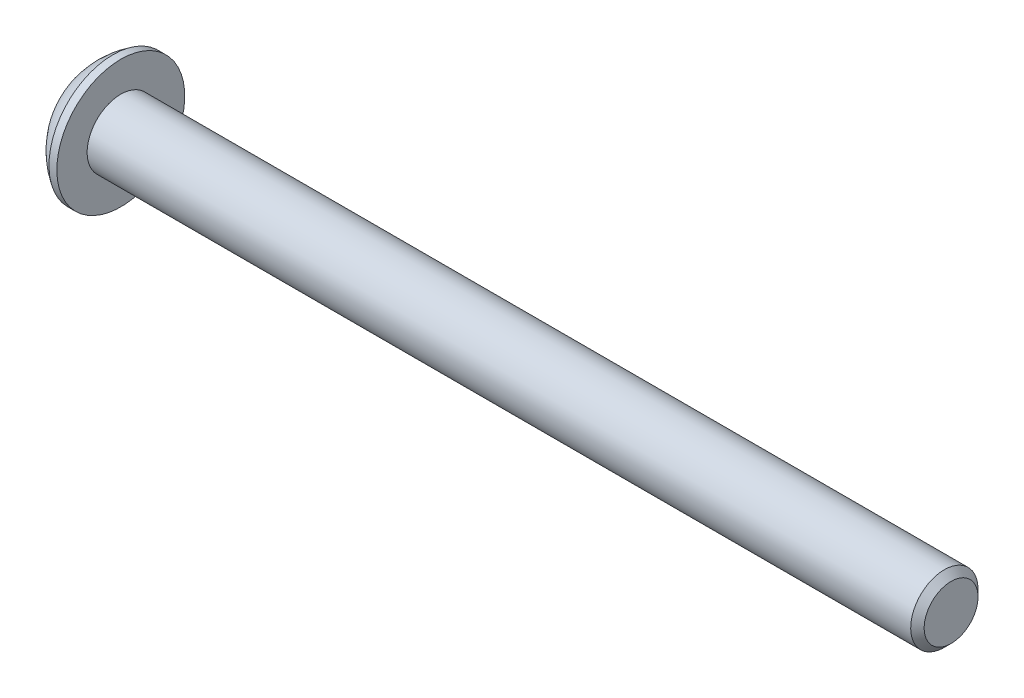
ISO-10303-21;
HEADER;
FILE_DESCRIPTION(('STEP AP214'),'2;1');
FILE_NAME('part.step','',(''),(''),'','','');
FILE_SCHEMA(('AUTOMOTIVE_DESIGN { 1 0 10303 214 1 1 1 1 }'));
ENDSEC;
DATA;
#1=APPLICATION_CONTEXT('core data for automotive mechanical design processes');
#2=APPLICATION_PROTOCOL_DEFINITION('international standard','automotive_design',2000,#1);
#3=PRODUCT_CONTEXT('',#1,'mechanical');
#4=PRODUCT('Part','Part','',(#3));
#5=PRODUCT_RELATED_PRODUCT_CATEGORY('part','',(#4));
#6=PRODUCT_DEFINITION_FORMATION('','',#4);
#7=PRODUCT_DEFINITION_CONTEXT('part definition',#1,'design');
#8=PRODUCT_DEFINITION('design','',#6,#7);
#9=PRODUCT_DEFINITION_SHAPE('','',#8);
#10=(LENGTH_UNIT() NAMED_UNIT(*) SI_UNIT(.MILLI.,.METRE.));
#11=(NAMED_UNIT(*) PLANE_ANGLE_UNIT() SI_UNIT($,.RADIAN.));
#12=(NAMED_UNIT(*) SI_UNIT($,.STERADIAN.) SOLID_ANGLE_UNIT());
#13=UNCERTAINTY_MEASURE_WITH_UNIT(LENGTH_MEASURE(1.E-05),#10,'distance_accuracy_value','');
#14=(GEOMETRIC_REPRESENTATION_CONTEXT(3) GLOBAL_UNCERTAINTY_ASSIGNED_CONTEXT((#13)) GLOBAL_UNIT_ASSIGNED_CONTEXT((#10,
#11,#12)) REPRESENTATION_CONTEXT('',''));
#15=CARTESIAN_POINT('',(0.,0.,0.));
#16=DIRECTION('',(0.,0.,1.));
#17=DIRECTION('',(1.,0.,0.));
#18=AXIS2_PLACEMENT_3D('',#15,#16,#17);
#19=CARTESIAN_POINT('',(52.2090947797094,2.50050000000001,0.));
#20=DIRECTION('',(1.,0.,0.));
#21=DIRECTION('',(0.,1.,0.));
#22=AXIS2_PLACEMENT_3D('',#19,#20,#21);
#23=PLANE('',#22);
#24=CARTESIAN_POINT('',(52.2090947797094,0.,0.));
#25=DIRECTION('',(1.,0.,0.));
#26=DIRECTION('',(0.,1.,0.));
#27=AXIS2_PLACEMENT_3D('',#24,#25,#26);
#28=CIRCLE('',#27,2.00040000000002);
#29=CARTESIAN_POINT('',(52.2090947797094,2.00040000000002,0.));
#30=VERTEX_POINT('',#29);
#31=EDGE_CURVE('E50',#30,#30,#28,.T.);
#32=ORIENTED_EDGE('',*,*,#31,.T.);
#33=EDGE_LOOP('',(#32));
#34=FACE_BOUND('',#33,.T.);
#35=ADVANCED_FACE('F41',(#34),#23,.T.);
#36=CARTESIAN_POINT('',(52.2090947797094,0.,0.));
#37=DIRECTION('',(1.,0.,0.));
#38=DIRECTION('',(0.,1.,0.));
#39=AXIS2_PLACEMENT_3D('',#36,#37,#38);
#40=CYLINDRICAL_SURFACE('',#39,2.50050000000001);
#41=CARTESIAN_POINT('',(51.7089947797094,0.,0.));
#42=DIRECTION('',(1.,0.,0.));
#43=DIRECTION('',(0.,1.,0.));
#44=AXIS2_PLACEMENT_3D('',#41,#42,#43);
#45=CIRCLE('',#44,2.50050000000001);
#46=CARTESIAN_POINT('',(51.7089947797094,2.50050000000001,0.));
#47=VERTEX_POINT('',#46);
#48=EDGE_CURVE('E11',#47,#47,#45,.F.);
#49=ORIENTED_EDGE('',*,*,#48,.T.);
#50=EDGE_LOOP('',(#49));
#51=FACE_BOUND('',#50,.T.);
#52=CARTESIAN_POINT('',(-9.46990522029058,0.,0.));
#53=DIRECTION('',(1.,0.,0.));
#54=DIRECTION('',(0.,1.,0.));
#55=AXIS2_PLACEMENT_3D('',#52,#53,#54);
#56=CIRCLE('',#55,2.50050000000001);
#57=CARTESIAN_POINT('',(-9.46990522029058,2.50050000000001,0.));
#58=VERTEX_POINT('',#57);
#59=EDGE_CURVE('E177',#58,#58,#56,.T.);
#60=ORIENTED_EDGE('',*,*,#59,.T.);
#61=EDGE_LOOP('',(#60));
#62=FACE_BOUND('',#61,.T.);
#63=ADVANCED_FACE('F200',(#51,#62),#40,.T.);
#64=CARTESIAN_POINT('',(-9.46990522029058,4.75095,0.));
#65=DIRECTION('',(1.,0.,0.));
#66=DIRECTION('',(0.,1.,0.));
#67=AXIS2_PLACEMENT_3D('',#64,#65,#66);
#68=PLANE('',#67);
#69=CARTESIAN_POINT('',(-9.46990522029058,0.,0.));
#70=DIRECTION('',(1.,0.,0.));
#71=DIRECTION('',(0.,1.,0.));
#72=AXIS2_PLACEMENT_3D('',#69,#70,#71);
#73=CIRCLE('',#72,4.75095);
#74=CARTESIAN_POINT('',(-9.46990522029058,4.75095,0.));
#75=VERTEX_POINT('',#74);
#76=EDGE_CURVE('E173',#75,#75,#73,.T.);
#77=ORIENTED_EDGE('',*,*,#76,.T.);
#78=EDGE_LOOP('',(#77));
#79=FACE_BOUND('',#78,.T.);
#80=ORIENTED_EDGE('',*,*,#59,.F.);
#81=EDGE_LOOP('',(#80));
#82=FACE_BOUND('',#81,.T.);
#83=ADVANCED_FACE('F204',(#79,#82),#68,.T.);
#84=CARTESIAN_POINT('',(52.2090947797094,0.,0.));
#85=DIRECTION('',(1.,0.,0.));
#86=DIRECTION('',(0.,1.,0.));
#87=AXIS2_PLACEMENT_3D('',#84,#85,#86);
#88=CYLINDRICAL_SURFACE('',#87,4.75095);
#89=CARTESIAN_POINT('',(-10.0533552202906,0.,0.));
#90=DIRECTION('',(1.,0.,0.));
#91=DIRECTION('',(0.,1.,0.));
#92=AXIS2_PLACEMENT_3D('',#89,#90,#91);
#93=CIRCLE('',#92,4.75095);
#94=CARTESIAN_POINT('',(-10.0533552202906,4.75095,0.));
#95=VERTEX_POINT('',#94);
#96=EDGE_CURVE('E169',#95,#95,#93,.T.);
#97=ORIENTED_EDGE('',*,*,#96,.T.);
#98=EDGE_LOOP('',(#97));
#99=FACE_BOUND('',#98,.T.);
#100=ORIENTED_EDGE('',*,*,#76,.F.);
#101=EDGE_LOOP('',(#100));
#102=FACE_BOUND('',#101,.T.);
#103=ADVANCED_FACE('F210',(#99,#102),#88,.T.);
#104=CARTESIAN_POINT('',(-6.99344923000314,0.,0.));
#105=DIRECTION('',(1.,0.,0.));
#106=DIRECTION('',(0.,1.,0.));
#107=AXIS2_PLACEMENT_3D('',#104,#105,#106);
#108=DEGENERATE_TOROIDAL_SURFACE('',#107,0.21678243850784,5.8345,.F.);
#109=CARTESIAN_POINT('',(-12.2204552202906,0.,0.));
#110=DIRECTION('',(1.,0.,0.));
#111=DIRECTION('',(0.,1.,0.));
#112=AXIS2_PLACEMENT_3D('',#109,#110,#111);
#113=CIRCLE('',#112,2.375475);
#114=CARTESIAN_POINT('',(-12.2204552202906,2.375475,0.));
#115=VERTEX_POINT('',#114);
#116=EDGE_CURVE('E156',#115,#115,#113,.T.);
#117=ORIENTED_EDGE('',*,*,#116,.T.);
#118=EDGE_LOOP('',(#117));
#119=FACE_BOUND('',#118,.T.);
#120=ORIENTED_EDGE('',*,*,#96,.F.);
#121=EDGE_LOOP('',(#120));
#122=FACE_BOUND('',#121,.T.);
#123=ADVANCED_FACE('F195',(#119,#122),#108,.F.);
#124=CARTESIAN_POINT('',(-12.2204552202906,0.,0.));
#125=DIRECTION('',(-1.,0.,0.));
#126=DIRECTION('',(0.,-1.,0.));
#127=AXIS2_PLACEMENT_3D('',#124,#125,#126);
#128=PLANE('',#127);
#129=DIRECTION('',(0.,0.5,-0.866025403784438));
#130=VECTOR('',#129,1.);
#131=CARTESIAN_POINT('',(-12.2204552202906,0.962442898739106,1.667));
#132=LINE('',#131,#130);
#133=CARTESIAN_POINT('',(-12.2204552202906,0.962442898739106,1.667));
#134=VERTEX_POINT('',#133);
#135=CARTESIAN_POINT('',(-12.2204552202906,1.92488579747821,0.));
#136=VERTEX_POINT('',#135);
#137=EDGE_CURVE('E57',#134,#136,#132,.T.);
#138=ORIENTED_EDGE('',*,*,#137,.F.);
#139=DIRECTION('',(0.,1.,0.));
#140=VECTOR('',#139,1.);
#141=CARTESIAN_POINT('',(-12.2204552202906,-0.962442898739108,1.667));
#142=LINE('',#141,#140);
#143=CARTESIAN_POINT('',(-12.2204552202906,-0.962442898739108,1.667));
#144=VERTEX_POINT('',#143);
#145=EDGE_CURVE('E150',#144,#134,#142,.T.);
#146=ORIENTED_EDGE('',*,*,#145,.F.);
#147=DIRECTION('',(0.,0.5,0.866025403784439));
#148=VECTOR('',#147,1.);
#149=CARTESIAN_POINT('',(-12.2204552202906,-1.92488579747821,0.));
#150=LINE('',#149,#148);
#151=CARTESIAN_POINT('',(-12.2204552202906,-1.92488579747821,0.));
#152=VERTEX_POINT('',#151);
#153=EDGE_CURVE('E147',#152,#144,#150,.T.);
#154=ORIENTED_EDGE('',*,*,#153,.F.);
#155=DIRECTION('',(0.,-0.5,0.866025403784439));
#156=VECTOR('',#155,1.);
#157=CARTESIAN_POINT('',(-12.2204552202906,-0.962442898739108,-1.667));
#158=LINE('',#157,#156);
#159=CARTESIAN_POINT('',(-12.2204552202906,-0.962442898739108,-1.667));
#160=VERTEX_POINT('',#159);
#161=EDGE_CURVE('E105',#160,#152,#158,.T.);
#162=ORIENTED_EDGE('',*,*,#161,.F.);
#163=DIRECTION('',(0.,-1.,0.));
#164=VECTOR('',#163,1.);
#165=CARTESIAN_POINT('',(-12.2204552202906,0.962442898739106,-1.667));
#166=LINE('',#165,#164);
#167=CARTESIAN_POINT('',(-12.2204552202906,0.962442898739106,-1.667));
#168=VERTEX_POINT('',#167);
#169=EDGE_CURVE('E141',#168,#160,#166,.T.);
#170=ORIENTED_EDGE('',*,*,#169,.F.);
#171=DIRECTION('',(0.,-0.5,-0.866025403784439));
#172=VECTOR('',#171,1.);
#173=CARTESIAN_POINT('',(-12.2204552202906,1.92488579747821,0.));
#174=LINE('',#173,#172);
#175=EDGE_CURVE('E137',#136,#168,#174,.T.);
#176=ORIENTED_EDGE('',*,*,#175,.F.);
#177=EDGE_LOOP('',(#138,#146,#154,#162,#170,#176));
#178=FACE_BOUND('',#177,.T.);
#179=ORIENTED_EDGE('',*,*,#116,.F.);
#180=EDGE_LOOP('',(#179));
#181=FACE_BOUND('',#180,.T.);
#182=ADVANCED_FACE('F187',(#178,#181),#128,.T.);
#183=CARTESIAN_POINT('',(52.2090947797094,0.,0.));
#184=DIRECTION('',(-1.,0.,0.));
#185=DIRECTION('',(0.,-1.,0.));
#186=AXIS2_PLACEMENT_3D('',#183,#184,#185);
#187=CONICAL_SURFACE('',#186,2.00040000000002,0.785398163397445);
#188=ORIENTED_EDGE('',*,*,#48,.F.);
#189=EDGE_LOOP('',(#188));
#190=FACE_BOUND('',#189,.T.);
#191=ORIENTED_EDGE('',*,*,#31,.F.);
#192=EDGE_LOOP('',(#191));
#193=FACE_BOUND('',#192,.T.);
#194=ADVANCED_FACE('F43',(#190,#193),#187,.T.);
#195=CARTESIAN_POINT('',(-10.5534552202906,0.962442898739106,1.667));
#196=DIRECTION('',(0.,0.866025403784439,0.5));
#197=DIRECTION('',(0.,-0.5,0.866025403784438));
#198=AXIS2_PLACEMENT_3D('',#195,#196,#197);
#199=PLANE('',#198);
#200=ORIENTED_EDGE('',*,*,#137,.T.);
#201=DIRECTION('',(-1.,0.,0.));
#202=VECTOR('',#201,1.);
#203=CARTESIAN_POINT('',(-10.5534552202906,1.92488579747821,0.));
#204=LINE('',#203,#202);
#205=CARTESIAN_POINT('',(-10.5534552202906,1.92488579747821,0.));
#206=VERTEX_POINT('',#205);
#207=EDGE_CURVE('E87',#206,#136,#204,.T.);
#208=ORIENTED_EDGE('',*,*,#207,.F.);
#209=DIRECTION('',(0.,0.5,-0.866025403784438));
#210=VECTOR('',#209,1.);
#211=CARTESIAN_POINT('',(-10.5534552202906,0.962442898739106,1.667));
#212=LINE('',#211,#210);
#213=CARTESIAN_POINT('',(-10.5534552202906,0.962442898739106,1.667));
#214=VERTEX_POINT('',#213);
#215=EDGE_CURVE('E153',#214,#206,#212,.T.);
#216=ORIENTED_EDGE('',*,*,#215,.F.);
#217=DIRECTION('',(-1.,0.,0.));
#218=VECTOR('',#217,1.);
#219=CARTESIAN_POINT('',(-10.5534552202906,0.962442898739106,1.667));
#220=LINE('',#219,#218);
#221=EDGE_CURVE('E65',#214,#134,#220,.T.);
#222=ORIENTED_EDGE('',*,*,#221,.T.);
#223=EDGE_LOOP('',(#200,#208,#216,#222));
#224=FACE_BOUND('',#223,.T.);
#225=ADVANCED_FACE('F186',(#224),#199,.F.);
#226=CARTESIAN_POINT('',(-10.5534552202906,-0.962442898739108,1.667));
#227=DIRECTION('',(0.,0.,1.));
#228=DIRECTION('',(0.,-1.,0.));
#229=AXIS2_PLACEMENT_3D('',#226,#227,#228);
#230=PLANE('',#229);
#231=ORIENTED_EDGE('',*,*,#145,.T.);
#232=ORIENTED_EDGE('',*,*,#221,.F.);
#233=DIRECTION('',(0.,1.,0.));
#234=VECTOR('',#233,1.);
#235=CARTESIAN_POINT('',(-10.5534552202906,-0.962442898739108,1.667));
#236=LINE('',#235,#234);
#237=CARTESIAN_POINT('',(-10.5534552202906,-0.962442898739108,1.667));
#238=VERTEX_POINT('',#237);
#239=EDGE_CURVE('E119',#238,#214,#236,.T.);
#240=ORIENTED_EDGE('',*,*,#239,.F.);
#241=DIRECTION('',(-1.,0.,0.));
#242=VECTOR('',#241,1.);
#243=CARTESIAN_POINT('',(-10.5534552202906,-0.962442898739108,1.667));
#244=LINE('',#243,#242);
#245=EDGE_CURVE('E110',#238,#144,#244,.T.);
#246=ORIENTED_EDGE('',*,*,#245,.T.);
#247=EDGE_LOOP('',(#231,#232,#240,#246));
#248=FACE_BOUND('',#247,.T.);
#249=ADVANCED_FACE('F193',(#248),#230,.F.);
#250=CARTESIAN_POINT('',(-10.5534552202906,-1.92488579747821,0.));
#251=DIRECTION('',(0.,-0.866025403784439,0.5));
#252=DIRECTION('',(0.,-0.5,-0.866025403784439));
#253=AXIS2_PLACEMENT_3D('',#250,#251,#252);
#254=PLANE('',#253);
#255=ORIENTED_EDGE('',*,*,#153,.T.);
#256=ORIENTED_EDGE('',*,*,#245,.F.);
#257=DIRECTION('',(0.,0.5,0.866025403784439));
#258=VECTOR('',#257,1.);
#259=CARTESIAN_POINT('',(-10.5534552202906,-1.92488579747821,0.));
#260=LINE('',#259,#258);
#261=CARTESIAN_POINT('',(-10.5534552202906,-1.92488579747821,0.));
#262=VERTEX_POINT('',#261);
#263=EDGE_CURVE('E114',#262,#238,#260,.T.);
#264=ORIENTED_EDGE('',*,*,#263,.F.);
#265=DIRECTION('',(-1.,0.,0.));
#266=VECTOR('',#265,1.);
#267=CARTESIAN_POINT('',(-10.5534552202906,-1.92488579747821,0.));
#268=LINE('',#267,#266);
#269=EDGE_CURVE('E98',#262,#152,#268,.T.);
#270=ORIENTED_EDGE('',*,*,#269,.T.);
#271=EDGE_LOOP('',(#255,#256,#264,#270));
#272=FACE_BOUND('',#271,.T.);
#273=ADVANCED_FACE('F115',(#272),#254,.F.);
#274=CARTESIAN_POINT('',(-10.5534552202906,-0.962442898739108,-1.667));
#275=DIRECTION('',(0.,-0.866025403784439,-0.5));
#276=DIRECTION('',(0.,0.5,-0.866025403784439));
#277=AXIS2_PLACEMENT_3D('',#274,#275,#276);
#278=PLANE('',#277);
#279=ORIENTED_EDGE('',*,*,#161,.T.);
#280=ORIENTED_EDGE('',*,*,#269,.F.);
#281=DIRECTION('',(0.,-0.5,0.866025403784439));
#282=VECTOR('',#281,1.);
#283=CARTESIAN_POINT('',(-10.5534552202906,-0.962442898739108,-1.667));
#284=LINE('',#283,#282);
#285=CARTESIAN_POINT('',(-10.5534552202906,-0.962442898739108,-1.667));
#286=VERTEX_POINT('',#285);
#287=EDGE_CURVE('E102',#286,#262,#284,.T.);
#288=ORIENTED_EDGE('',*,*,#287,.F.);
#289=DIRECTION('',(-1.,0.,0.));
#290=VECTOR('',#289,1.);
#291=CARTESIAN_POINT('',(-10.5534552202906,-0.962442898739108,-1.667));
#292=LINE('',#291,#290);
#293=EDGE_CURVE('E111',#286,#160,#292,.T.);
#294=ORIENTED_EDGE('',*,*,#293,.T.);
#295=EDGE_LOOP('',(#279,#280,#288,#294));
#296=FACE_BOUND('',#295,.T.);
#297=ADVANCED_FACE('F100',(#296),#278,.F.);
#298=CARTESIAN_POINT('',(-10.5534552202906,0.962442898739106,-1.667));
#299=DIRECTION('',(0.,0.,-1.));
#300=DIRECTION('',(-1.,0.,0.));
#301=AXIS2_PLACEMENT_3D('',#298,#299,#300);
#302=PLANE('',#301);
#303=ORIENTED_EDGE('',*,*,#169,.T.);
#304=ORIENTED_EDGE('',*,*,#293,.F.);
#305=DIRECTION('',(0.,-1.,0.));
#306=VECTOR('',#305,1.);
#307=CARTESIAN_POINT('',(-10.5534552202906,0.962442898739106,-1.667));
#308=LINE('',#307,#306);
#309=CARTESIAN_POINT('',(-10.5534552202906,0.962442898739106,-1.667));
#310=VERTEX_POINT('',#309);
#311=EDGE_CURVE('E125',#310,#286,#308,.T.);
#312=ORIENTED_EDGE('',*,*,#311,.F.);
#313=DIRECTION('',(-1.,0.,0.));
#314=VECTOR('',#313,1.);
#315=CARTESIAN_POINT('',(-10.5534552202906,0.962442898739106,-1.667));
#316=LINE('',#315,#314);
#317=EDGE_CURVE('E161',#310,#168,#316,.T.);
#318=ORIENTED_EDGE('',*,*,#317,.T.);
#319=EDGE_LOOP('',(#303,#304,#312,#318));
#320=FACE_BOUND('',#319,.T.);
#321=ADVANCED_FACE('F221',(#320),#302,.F.);
#322=CARTESIAN_POINT('',(-10.5534552202906,1.92488579747821,0.));
#323=DIRECTION('',(0.,0.866025403784439,-0.5));
#324=DIRECTION('',(0.,0.5,0.866025403784439));
#325=AXIS2_PLACEMENT_3D('',#322,#323,#324);
#326=PLANE('',#325);
#327=ORIENTED_EDGE('',*,*,#175,.T.);
#328=ORIENTED_EDGE('',*,*,#317,.F.);
#329=DIRECTION('',(0.,-0.5,-0.866025403784439));
#330=VECTOR('',#329,1.);
#331=CARTESIAN_POINT('',(-10.5534552202906,1.92488579747821,0.));
#332=LINE('',#331,#330);
#333=EDGE_CURVE('E129',#206,#310,#332,.T.);
#334=ORIENTED_EDGE('',*,*,#333,.F.);
#335=ORIENTED_EDGE('',*,*,#207,.T.);
#336=EDGE_LOOP('',(#327,#328,#334,#335));
#337=FACE_BOUND('',#336,.T.);
#338=ADVANCED_FACE('F218',(#337),#326,.F.);
#339=CARTESIAN_POINT('',(-10.5534552202906,0.,0.));
#340=DIRECTION('',(-1.,0.,0.));
#341=DIRECTION('',(0.,-1.,0.));
#342=AXIS2_PLACEMENT_3D('',#339,#340,#341);
#343=PLANE('',#342);
#344=ORIENTED_EDGE('',*,*,#215,.T.);
#345=ORIENTED_EDGE('',*,*,#333,.T.);
#346=ORIENTED_EDGE('',*,*,#311,.T.);
#347=ORIENTED_EDGE('',*,*,#287,.T.);
#348=ORIENTED_EDGE('',*,*,#263,.T.);
#349=ORIENTED_EDGE('',*,*,#239,.T.);
#350=EDGE_LOOP('',(#344,#345,#346,#347,#348,#349));
#351=FACE_BOUND('',#350,.T.);
#352=ADVANCED_FACE('F122',(#351),#343,.T.);
#353=CLOSED_SHELL('',(#35,#63,#83,#103,#123,#182,#194,#225,#249,#273,#297,#321,#338,#352));
#354=MANIFOLD_SOLID_BREP('B2',#353);
#355=ADVANCED_BREP_SHAPE_REPRESENTATION('',(#18,#354),#14);
#356=SHAPE_DEFINITION_REPRESENTATION(#9,#355);
ENDSEC;
END-ISO-10303-21;
